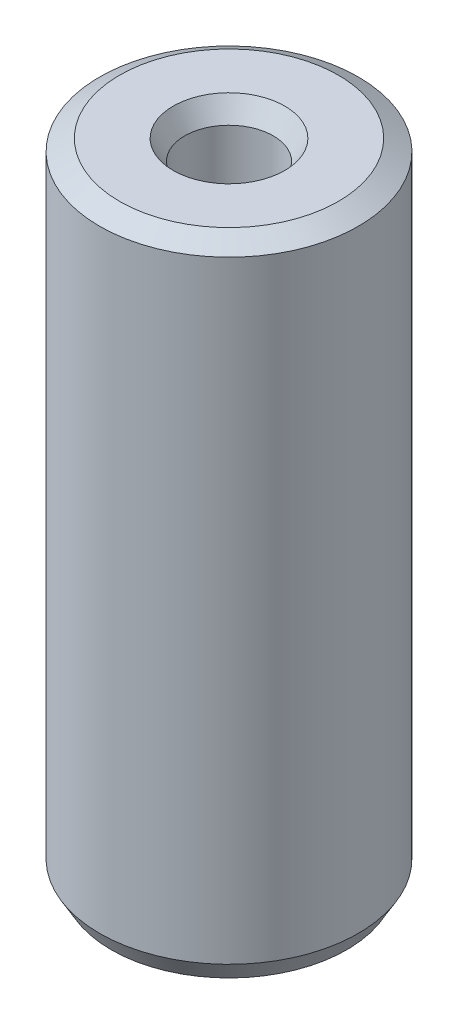
ISO-10303-21;
HEADER;
FILE_DESCRIPTION(('STEP AP214'),'2;1');
FILE_NAME('part.step','',(''),(''),'','','');
FILE_SCHEMA(('AUTOMOTIVE_DESIGN { 1 0 10303 214 1 1 1 1 }'));
ENDSEC;
DATA;
#1=APPLICATION_CONTEXT('core data for automotive mechanical design processes');
#2=APPLICATION_PROTOCOL_DEFINITION('international standard','automotive_design',2000,#1);
#3=PRODUCT_CONTEXT('',#1,'mechanical');
#4=PRODUCT('Part','Part','',(#3));
#5=PRODUCT_RELATED_PRODUCT_CATEGORY('part','',(#4));
#6=PRODUCT_DEFINITION_FORMATION('','',#4);
#7=PRODUCT_DEFINITION_CONTEXT('part definition',#1,'design');
#8=PRODUCT_DEFINITION('design','',#6,#7);
#9=PRODUCT_DEFINITION_SHAPE('','',#8);
#10=(LENGTH_UNIT() NAMED_UNIT(*) SI_UNIT(.MILLI.,.METRE.));
#11=(NAMED_UNIT(*) PLANE_ANGLE_UNIT() SI_UNIT($,.RADIAN.));
#12=(NAMED_UNIT(*) SI_UNIT($,.STERADIAN.) SOLID_ANGLE_UNIT());
#13=UNCERTAINTY_MEASURE_WITH_UNIT(LENGTH_MEASURE(1.E-05),#10,'distance_accuracy_value','');
#14=(GEOMETRIC_REPRESENTATION_CONTEXT(3) GLOBAL_UNCERTAINTY_ASSIGNED_CONTEXT((#13)) GLOBAL_UNIT_ASSIGNED_CONTEXT((#10,
#11,#12)) REPRESENTATION_CONTEXT('',''));
#15=CARTESIAN_POINT('',(0.,0.,0.));
#16=DIRECTION('',(0.,0.,1.));
#17=DIRECTION('',(1.,0.,0.));
#18=AXIS2_PLACEMENT_3D('',#15,#16,#17);
#19=CARTESIAN_POINT('',(0.,24.885067257914,0.));
#20=DIRECTION('',(0.,-1.,0.));
#21=DIRECTION('',(0.,0.,-1.));
#22=AXIS2_PLACEMENT_3D('',#19,#20,#21);
#23=CYLINDRICAL_SURFACE('',#22,5.);
#24=CARTESIAN_POINT('',(0.,0.772291829290381,0.));
#25=DIRECTION('',(0.,1.,0.));
#26=DIRECTION('',(0.,0.,1.));
#27=AXIS2_PLACEMENT_3D('',#24,#25,#26);
#28=CIRCLE('',#27,5.);
#29=CARTESIAN_POINT('',(0.,0.772291829290381,5.));
#30=VERTEX_POINT('',#29);
#31=EDGE_CURVE('E10',#30,#30,#28,.T.);
#32=ORIENTED_EDGE('',*,*,#31,.T.);
#33=EDGE_LOOP('',(#32));
#34=FACE_BOUND('',#33,.T.);
#35=CARTESIAN_POINT('',(0.,24.4391843623803,0.));
#36=DIRECTION('',(0.,1.,0.));
#37=DIRECTION('',(0.,0.,1.));
#38=AXIS2_PLACEMENT_3D('',#35,#36,#37);
#39=CIRCLE('',#38,5.);
#40=CARTESIAN_POINT('',(0.,24.4391843623803,5.));
#41=VERTEX_POINT('',#40);
#42=EDGE_CURVE('E50',#41,#41,#39,.F.);
#43=ORIENTED_EDGE('',*,*,#42,.T.);
#44=EDGE_LOOP('',(#43));
#45=FACE_BOUND('',#44,.T.);
#46=ADVANCED_FACE('F39',(#34,#45),#23,.T.);
#47=CARTESIAN_POINT('',(0.,24.885067257914,0.));
#48=DIRECTION('',(0.,1.,0.));
#49=DIRECTION('',(0.,0.,1.));
#50=AXIS2_PLACEMENT_3D('',#47,#48,#49);
#51=PLANE('',#50);
#52=CARTESIAN_POINT('',(0.,24.885067257914,0.));
#53=DIRECTION('',(0.,1.,0.));
#54=DIRECTION('',(0.,0.,1.));
#55=AXIS2_PLACEMENT_3D('',#52,#53,#54);
#56=CIRCLE('',#55,2.15675604679921);
#57=CARTESIAN_POINT('',(0.,24.885067257914,2.15675604679921));
#58=VERTEX_POINT('',#57);
#59=EDGE_CURVE('E58',#58,#58,#56,.F.);
#60=ORIENTED_EDGE('',*,*,#59,.T.);
#61=EDGE_LOOP('',(#60));
#62=FACE_BOUND('',#61,.T.);
#63=CARTESIAN_POINT('',(0.,24.885067257914,0.));
#64=DIRECTION('',(0.,1.,0.));
#65=DIRECTION('',(0.,0.,1.));
#66=AXIS2_PLACEMENT_3D('',#63,#64,#65);
#67=CIRCLE('',#66,4.22770817070961);
#68=CARTESIAN_POINT('',(0.,24.885067257914,4.22770817070961));
#69=VERTEX_POINT('',#68);
#70=EDGE_CURVE('E61',#69,#69,#67,.T.);
#71=ORIENTED_EDGE('',*,*,#70,.T.);
#72=EDGE_LOOP('',(#71));
#73=FACE_BOUND('',#72,.T.);
#74=ADVANCED_FACE('F88',(#62,#73),#51,.T.);
#75=CARTESIAN_POINT('',(0.,0.,0.));
#76=DIRECTION('',(0.,1.,0.));
#77=DIRECTION('',(0.,0.,1.));
#78=AXIS2_PLACEMENT_3D('',#75,#76,#77);
#79=PLANE('',#78);
#80=CARTESIAN_POINT('',(0.,0.,0.));
#81=DIRECTION('',(0.,1.,0.));
#82=DIRECTION('',(0.,0.,1.));
#83=AXIS2_PLACEMENT_3D('',#80,#81,#82);
#84=CIRCLE('',#83,2.48316498055584);
#85=CARTESIAN_POINT('',(0.,0.,2.48316498055584));
#86=VERTEX_POINT('',#85);
#87=EDGE_CURVE('E51',#86,#86,#84,.T.);
#88=ORIENTED_EDGE('',*,*,#87,.T.);
#89=EDGE_LOOP('',(#88));
#90=FACE_BOUND('',#89,.T.);
#91=CARTESIAN_POINT('',(0.,0.,0.));
#92=DIRECTION('',(0.,1.,0.));
#93=DIRECTION('',(0.,0.,1.));
#94=AXIS2_PLACEMENT_3D('',#91,#92,#93);
#95=CIRCLE('',#94,4.55411710446625);
#96=CARTESIAN_POINT('',(0.,0.,4.55411710446625));
#97=VERTEX_POINT('',#96);
#98=EDGE_CURVE('E54',#97,#97,#95,.F.);
#99=ORIENTED_EDGE('',*,*,#98,.T.);
#100=EDGE_LOOP('',(#99));
#101=FACE_BOUND('',#100,.T.);
#102=ADVANCED_FACE('F83',(#90,#101),#79,.F.);
#103=CARTESIAN_POINT('',(0.,24.885067257914,0.));
#104=DIRECTION('',(0.,-1.,0.));
#105=DIRECTION('',(0.,0.,-1.));
#106=AXIS2_PLACEMENT_3D('',#103,#104,#105);
#107=CYLINDRICAL_SURFACE('',#106,1.71087315126545);
#108=CARTESIAN_POINT('',(0.,24.1127754286236,0.));
#109=DIRECTION('',(0.,1.,0.));
#110=DIRECTION('',(0.,0.,1.));
#111=AXIS2_PLACEMENT_3D('',#108,#109,#110);
#112=CIRCLE('',#111,1.71087315126545);
#113=CARTESIAN_POINT('',(0.,24.1127754286236,1.71087315126545));
#114=VERTEX_POINT('',#113);
#115=EDGE_CURVE('E67',#114,#114,#112,.T.);
#116=ORIENTED_EDGE('',*,*,#115,.T.);
#117=EDGE_LOOP('',(#116));
#118=FACE_BOUND('',#117,.T.);
#119=CARTESIAN_POINT('',(0.,0.445882895533756,0.));
#120=DIRECTION('',(0.,1.,0.));
#121=DIRECTION('',(0.,0.,1.));
#122=AXIS2_PLACEMENT_3D('',#119,#120,#121);
#123=CIRCLE('',#122,1.71087315126545);
#124=CARTESIAN_POINT('',(0.,0.445882895533756,1.71087315126545));
#125=VERTEX_POINT('',#124);
#126=EDGE_CURVE('E69',#125,#125,#123,.F.);
#127=ORIENTED_EDGE('',*,*,#126,.T.);
#128=EDGE_LOOP('',(#127));
#129=FACE_BOUND('',#128,.T.);
#130=ADVANCED_FACE('F71',(#118,#129),#107,.F.);
#131=CARTESIAN_POINT('',(0.,24.1127754286236,0.));
#132=DIRECTION('',(0.,1.,0.));
#133=DIRECTION('',(0.,0.,1.));
#134=AXIS2_PLACEMENT_3D('',#131,#132,#133);
#135=CONICAL_SURFACE('',#134,1.71087315126545,0.5235987755983);
#136=ORIENTED_EDGE('',*,*,#59,.F.);
#137=EDGE_LOOP('',(#136));
#138=FACE_BOUND('',#137,.T.);
#139=ORIENTED_EDGE('',*,*,#115,.F.);
#140=EDGE_LOOP('',(#139));
#141=FACE_BOUND('',#140,.T.);
#142=ADVANCED_FACE('F77',(#138,#141),#135,.F.);
#143=CARTESIAN_POINT('',(0.,0.,0.));
#144=DIRECTION('',(0.,-1.,0.));
#145=DIRECTION('',(0.,0.,-1.));
#146=AXIS2_PLACEMENT_3D('',#143,#144,#145);
#147=CONICAL_SURFACE('',#146,2.48316498055584,1.04719755119659);
#148=ORIENTED_EDGE('',*,*,#126,.F.);
#149=EDGE_LOOP('',(#148));
#150=FACE_BOUND('',#149,.T.);
#151=ORIENTED_EDGE('',*,*,#87,.F.);
#152=EDGE_LOOP('',(#151));
#153=FACE_BOUND('',#152,.T.);
#154=ADVANCED_FACE('F73',(#150,#153),#147,.F.);
#155=CARTESIAN_POINT('',(0.,0.772291829290381,0.));
#156=DIRECTION('',(0.,1.,0.));
#157=DIRECTION('',(0.,0.,1.));
#158=AXIS2_PLACEMENT_3D('',#155,#156,#157);
#159=CONICAL_SURFACE('',#158,5.,0.523598775598301);
#160=ORIENTED_EDGE('',*,*,#98,.F.);
#161=EDGE_LOOP('',(#160));
#162=FACE_BOUND('',#161,.T.);
#163=ORIENTED_EDGE('',*,*,#31,.F.);
#164=EDGE_LOOP('',(#163));
#165=FACE_BOUND('',#164,.T.);
#166=ADVANCED_FACE('F76',(#162,#165),#159,.T.);
#167=CARTESIAN_POINT('',(0.,24.885067257914,0.));
#168=DIRECTION('',(0.,-1.,0.));
#169=DIRECTION('',(0.,0.,-1.));
#170=AXIS2_PLACEMENT_3D('',#167,#168,#169);
#171=CONICAL_SURFACE('',#170,4.22770817070961,1.04719755119659);
#172=ORIENTED_EDGE('',*,*,#42,.F.);
#173=EDGE_LOOP('',(#172));
#174=FACE_BOUND('',#173,.T.);
#175=ORIENTED_EDGE('',*,*,#70,.F.);
#176=EDGE_LOOP('',(#175));
#177=FACE_BOUND('',#176,.T.);
#178=ADVANCED_FACE('F45',(#174,#177),#171,.T.);
#179=CLOSED_SHELL('',(#46,#74,#102,#130,#142,#154,#166,#178));
#180=MANIFOLD_SOLID_BREP('B2',#179);
#181=ADVANCED_BREP_SHAPE_REPRESENTATION('',(#18,#180),#14);
#182=SHAPE_DEFINITION_REPRESENTATION(#9,#181);
ENDSEC;
END-ISO-10303-21;
